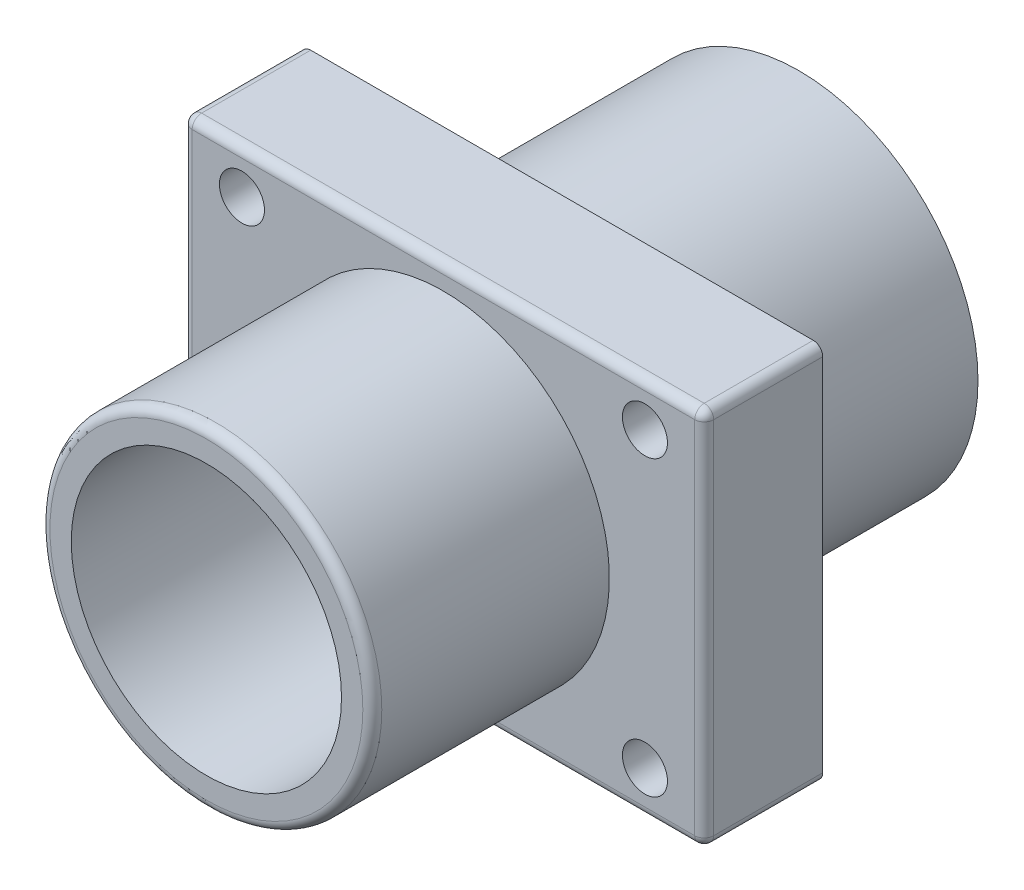
ISO-10303-21;
HEADER;
FILE_DESCRIPTION(('STEP AP214'),'2;1');
FILE_NAME('part.step','',(''),(''),'','','');
FILE_SCHEMA(('AUTOMOTIVE_DESIGN { 1 0 10303 214 1 1 1 1 }'));
ENDSEC;
DATA;
#1=APPLICATION_CONTEXT('core data for automotive mechanical design processes');
#2=APPLICATION_PROTOCOL_DEFINITION('international standard','automotive_design',2000,#1);
#3=PRODUCT_CONTEXT('',#1,'mechanical');
#4=PRODUCT('Part','Part','',(#3));
#5=PRODUCT_RELATED_PRODUCT_CATEGORY('part','',(#4));
#6=PRODUCT_DEFINITION_FORMATION('','',#4);
#7=PRODUCT_DEFINITION_CONTEXT('part definition',#1,'design');
#8=PRODUCT_DEFINITION('design','',#6,#7);
#9=PRODUCT_DEFINITION_SHAPE('','',#8);
#10=(LENGTH_UNIT() NAMED_UNIT(*) SI_UNIT(.MILLI.,.METRE.));
#11=(NAMED_UNIT(*) PLANE_ANGLE_UNIT() SI_UNIT($,.RADIAN.));
#12=(NAMED_UNIT(*) SI_UNIT($,.STERADIAN.) SOLID_ANGLE_UNIT());
#13=UNCERTAINTY_MEASURE_WITH_UNIT(LENGTH_MEASURE(1.E-05),#10,'distance_accuracy_value','');
#14=(GEOMETRIC_REPRESENTATION_CONTEXT(3) GLOBAL_UNCERTAINTY_ASSIGNED_CONTEXT((#13)) GLOBAL_UNIT_ASSIGNED_CONTEXT((#10,
#11,#12)) REPRESENTATION_CONTEXT('',''));
#15=CARTESIAN_POINT('',(0.,0.,0.));
#16=DIRECTION('',(0.,0.,1.));
#17=DIRECTION('',(1.,0.,0.));
#18=AXIS2_PLACEMENT_3D('',#15,#16,#17);
#19=CARTESIAN_POINT('',(42.5,30.9,0.));
#20=DIRECTION('',(0.,0.,1.));
#21=DIRECTION('',(1.,0.,0.));
#22=AXIS2_PLACEMENT_3D('',#19,#20,#21);
#23=CYLINDRICAL_SURFACE('',#22,4.75);
#24=CARTESIAN_POINT('',(42.5,30.9,0.));
#25=DIRECTION('',(0.,0.,1.));
#26=DIRECTION('',(1.,0.,0.));
#27=AXIS2_PLACEMENT_3D('',#24,#25,#26);
#28=CIRCLE('',#27,4.75);
#29=CARTESIAN_POINT('',(47.25,30.9,0.));
#30=VERTEX_POINT('',#29);
#31=EDGE_CURVE('E154',#30,#30,#28,.T.);
#32=ORIENTED_EDGE('',*,*,#31,.F.);
#33=EDGE_LOOP('',(#32));
#34=FACE_BOUND('',#33,.T.);
#35=CARTESIAN_POINT('',(42.5,30.9,25.));
#36=DIRECTION('',(0.,0.,1.));
#37=DIRECTION('',(1.,0.,0.));
#38=AXIS2_PLACEMENT_3D('',#35,#36,#37);
#39=CIRCLE('',#38,4.75);
#40=CARTESIAN_POINT('',(47.25,30.9,25.));
#41=VERTEX_POINT('',#40);
#42=EDGE_CURVE('E157',#41,#41,#39,.T.);
#43=ORIENTED_EDGE('',*,*,#42,.T.);
#44=EDGE_LOOP('',(#43));
#45=FACE_BOUND('',#44,.T.);
#46=ADVANCED_FACE('F35',(#34,#45),#23,.F.);
#47=CARTESIAN_POINT('',(-42.5,30.9,0.));
#48=DIRECTION('',(0.,0.,1.));
#49=DIRECTION('',(1.,0.,0.));
#50=AXIS2_PLACEMENT_3D('',#47,#48,#49);
#51=CYLINDRICAL_SURFACE('',#50,4.75);
#52=CARTESIAN_POINT('',(-42.5,30.9,0.));
#53=DIRECTION('',(0.,0.,1.));
#54=DIRECTION('',(1.,0.,0.));
#55=AXIS2_PLACEMENT_3D('',#52,#53,#54);
#56=CIRCLE('',#55,4.75);
#57=CARTESIAN_POINT('',(-37.75,30.9,0.));
#58=VERTEX_POINT('',#57);
#59=EDGE_CURVE('E143',#58,#58,#56,.T.);
#60=ORIENTED_EDGE('',*,*,#59,.F.);
#61=EDGE_LOOP('',(#60));
#62=FACE_BOUND('',#61,.T.);
#63=CARTESIAN_POINT('',(-42.5,30.9,25.));
#64=DIRECTION('',(0.,0.,1.));
#65=DIRECTION('',(1.,0.,0.));
#66=AXIS2_PLACEMENT_3D('',#63,#64,#65);
#67=CIRCLE('',#66,4.75);
#68=CARTESIAN_POINT('',(-37.75,30.9,25.));
#69=VERTEX_POINT('',#68);
#70=EDGE_CURVE('E151',#69,#69,#67,.T.);
#71=ORIENTED_EDGE('',*,*,#70,.T.);
#72=EDGE_LOOP('',(#71));
#73=FACE_BOUND('',#72,.T.);
#74=ADVANCED_FACE('F314',(#62,#73),#51,.F.);
#75=CARTESIAN_POINT('',(55.,-40.,25.));
#76=DIRECTION('',(-1.,0.,0.));
#77=DIRECTION('',(0.,0.,1.));
#78=AXIS2_PLACEMENT_3D('',#75,#76,#77);
#79=PLANE('',#78);
#80=DIRECTION('',(0.,1.,0.));
#81=VECTOR('',#80,1.);
#82=CARTESIAN_POINT('',(55.,-40.,0.));
#83=LINE('',#82,#81);
#84=CARTESIAN_POINT('',(55.,-38.,0.));
#85=VERTEX_POINT('',#84);
#86=CARTESIAN_POINT('',(55.,38.,0.));
#87=VERTEX_POINT('',#86);
#88=EDGE_CURVE('E145',#85,#87,#83,.T.);
#89=ORIENTED_EDGE('',*,*,#88,.T.);
#90=DIRECTION('',(0.,0.,-1.));
#91=VECTOR('',#90,1.);
#92=CARTESIAN_POINT('',(55.,38.,25.));
#93=LINE('',#92,#91);
#94=CARTESIAN_POINT('',(55.,38.,23.));
#95=VERTEX_POINT('',#94);
#96=EDGE_CURVE('E189',#87,#95,#93,.F.);
#97=ORIENTED_EDGE('',*,*,#96,.T.);
#98=DIRECTION('',(0.,1.,0.));
#99=VECTOR('',#98,1.);
#100=CARTESIAN_POINT('',(55.,-40.,23.));
#101=LINE('',#100,#99);
#102=CARTESIAN_POINT('',(55.,-38.,23.));
#103=VERTEX_POINT('',#102);
#104=EDGE_CURVE('E185',#95,#103,#101,.F.);
#105=ORIENTED_EDGE('',*,*,#104,.T.);
#106=DIRECTION('',(0.,0.,-1.));
#107=VECTOR('',#106,1.);
#108=CARTESIAN_POINT('',(55.,-38.,25.));
#109=LINE('',#108,#107);
#110=EDGE_CURVE('E187',#103,#85,#109,.T.);
#111=ORIENTED_EDGE('',*,*,#110,.T.);
#112=EDGE_LOOP('',(#89,#97,#105,#111));
#113=FACE_BOUND('',#112,.T.);
#114=ADVANCED_FACE('F268',(#113),#79,.F.);
#115=CARTESIAN_POINT('',(-55.,40.,25.));
#116=DIRECTION('',(0.,-1.,0.));
#117=DIRECTION('',(0.,0.,-1.));
#118=AXIS2_PLACEMENT_3D('',#115,#116,#117);
#119=PLANE('',#118);
#120=DIRECTION('',(-1.,0.,0.));
#121=VECTOR('',#120,1.);
#122=CARTESIAN_POINT('',(-55.,40.,0.));
#123=LINE('',#122,#121);
#124=CARTESIAN_POINT('',(53.,40.,0.));
#125=VERTEX_POINT('',#124);
#126=CARTESIAN_POINT('',(-53.,40.,0.));
#127=VERTEX_POINT('',#126);
#128=EDGE_CURVE('E140',#125,#127,#123,.T.);
#129=ORIENTED_EDGE('',*,*,#128,.T.);
#130=DIRECTION('',(0.,0.,-1.));
#131=VECTOR('',#130,1.);
#132=CARTESIAN_POINT('',(-53.,40.,25.));
#133=LINE('',#132,#131);
#134=CARTESIAN_POINT('',(-53.,40.,23.));
#135=VERTEX_POINT('',#134);
#136=EDGE_CURVE('E116',#127,#135,#133,.F.);
#137=ORIENTED_EDGE('',*,*,#136,.T.);
#138=DIRECTION('',(-1.,0.,0.));
#139=VECTOR('',#138,1.);
#140=CARTESIAN_POINT('',(-55.,40.,23.));
#141=LINE('',#140,#139);
#142=CARTESIAN_POINT('',(53.,40.,23.));
#143=VERTEX_POINT('',#142);
#144=EDGE_CURVE('E121',#135,#143,#141,.F.);
#145=ORIENTED_EDGE('',*,*,#144,.T.);
#146=DIRECTION('',(0.,0.,-1.));
#147=VECTOR('',#146,1.);
#148=CARTESIAN_POINT('',(53.,40.,25.));
#149=LINE('',#148,#147);
#150=EDGE_CURVE('E176',#143,#125,#149,.T.);
#151=ORIENTED_EDGE('',*,*,#150,.T.);
#152=EDGE_LOOP('',(#129,#137,#145,#151));
#153=FACE_BOUND('',#152,.T.);
#154=ADVANCED_FACE('F306',(#153),#119,.F.);
#155=CARTESIAN_POINT('',(-55.,-40.,25.));
#156=DIRECTION('',(1.,0.,0.));
#157=DIRECTION('',(0.,0.,-1.));
#158=AXIS2_PLACEMENT_3D('',#155,#156,#157);
#159=PLANE('',#158);
#160=DIRECTION('',(0.,-1.,0.));
#161=VECTOR('',#160,1.);
#162=CARTESIAN_POINT('',(-55.,-40.,23.));
#163=LINE('',#162,#161);
#164=CARTESIAN_POINT('',(-55.,-38.,23.));
#165=VERTEX_POINT('',#164);
#166=CARTESIAN_POINT('',(-55.,38.,23.));
#167=VERTEX_POINT('',#166);
#168=EDGE_CURVE('E130',#165,#167,#163,.F.);
#169=ORIENTED_EDGE('',*,*,#168,.T.);
#170=DIRECTION('',(0.,0.,-1.));
#171=VECTOR('',#170,1.);
#172=CARTESIAN_POINT('',(-55.,38.,25.));
#173=LINE('',#172,#171);
#174=CARTESIAN_POINT('',(-55.,38.,0.));
#175=VERTEX_POINT('',#174);
#176=EDGE_CURVE('E115',#167,#175,#173,.T.);
#177=ORIENTED_EDGE('',*,*,#176,.T.);
#178=DIRECTION('',(0.,-1.,0.));
#179=VECTOR('',#178,1.);
#180=CARTESIAN_POINT('',(-55.,-40.,0.));
#181=LINE('',#180,#179);
#182=CARTESIAN_POINT('',(-55.,-38.,0.));
#183=VERTEX_POINT('',#182);
#184=EDGE_CURVE('E127',#175,#183,#181,.T.);
#185=ORIENTED_EDGE('',*,*,#184,.T.);
#186=DIRECTION('',(0.,0.,-1.));
#187=VECTOR('',#186,1.);
#188=CARTESIAN_POINT('',(-55.,-38.,25.));
#189=LINE('',#188,#187);
#190=EDGE_CURVE('E133',#183,#165,#189,.F.);
#191=ORIENTED_EDGE('',*,*,#190,.T.);
#192=EDGE_LOOP('',(#169,#177,#185,#191));
#193=FACE_BOUND('',#192,.T.);
#194=ADVANCED_FACE('F126',(#193),#159,.F.);
#195=CARTESIAN_POINT('',(-55.,-40.,25.));
#196=DIRECTION('',(0.,1.,0.));
#197=DIRECTION('',(0.,0.,1.));
#198=AXIS2_PLACEMENT_3D('',#195,#196,#197);
#199=PLANE('',#198);
#200=DIRECTION('',(1.,0.,0.));
#201=VECTOR('',#200,1.);
#202=CARTESIAN_POINT('',(-55.,-40.,23.));
#203=LINE('',#202,#201);
#204=CARTESIAN_POINT('',(53.,-40.,23.));
#205=VERTEX_POINT('',#204);
#206=CARTESIAN_POINT('',(-53.,-40.,23.));
#207=VERTEX_POINT('',#206);
#208=EDGE_CURVE('E179',#205,#207,#203,.F.);
#209=ORIENTED_EDGE('',*,*,#208,.T.);
#210=DIRECTION('',(0.,0.,-1.));
#211=VECTOR('',#210,1.);
#212=CARTESIAN_POINT('',(-53.,-40.,25.));
#213=LINE('',#212,#211);
#214=CARTESIAN_POINT('',(-53.,-40.,0.));
#215=VERTEX_POINT('',#214);
#216=EDGE_CURVE('E183',#207,#215,#213,.T.);
#217=ORIENTED_EDGE('',*,*,#216,.T.);
#218=DIRECTION('',(1.,0.,0.));
#219=VECTOR('',#218,1.);
#220=CARTESIAN_POINT('',(-55.,-40.,0.));
#221=LINE('',#220,#219);
#222=CARTESIAN_POINT('',(53.,-40.,0.));
#223=VERTEX_POINT('',#222);
#224=EDGE_CURVE('E139',#215,#223,#221,.T.);
#225=ORIENTED_EDGE('',*,*,#224,.T.);
#226=DIRECTION('',(0.,0.,-1.));
#227=VECTOR('',#226,1.);
#228=CARTESIAN_POINT('',(53.,-40.,25.));
#229=LINE('',#228,#227);
#230=EDGE_CURVE('E181',#223,#205,#229,.F.);
#231=ORIENTED_EDGE('',*,*,#230,.T.);
#232=EDGE_LOOP('',(#209,#217,#225,#231));
#233=FACE_BOUND('',#232,.T.);
#234=ADVANCED_FACE('F284',(#233),#199,.F.);
#235=CARTESIAN_POINT('',(0.,0.,25.));
#236=DIRECTION('',(0.,0.,-1.));
#237=DIRECTION('',(-1.,0.,0.));
#238=AXIS2_PLACEMENT_3D('',#235,#236,#237);
#239=PLANE('',#238);
#240=DIRECTION('',(0.,-1.,0.));
#241=VECTOR('',#240,1.);
#242=CARTESIAN_POINT('',(-53.,0.,25.));
#243=LINE('',#242,#241);
#244=CARTESIAN_POINT('',(-53.,38.,25.));
#245=VERTEX_POINT('',#244);
#246=CARTESIAN_POINT('',(-53.,-38.,25.));
#247=VERTEX_POINT('',#246);
#248=EDGE_CURVE('E44',#245,#247,#243,.T.);
#249=ORIENTED_EDGE('',*,*,#248,.T.);
#250=DIRECTION('',(1.,0.,0.));
#251=VECTOR('',#250,1.);
#252=CARTESIAN_POINT('',(0.,-38.,25.));
#253=LINE('',#252,#251);
#254=CARTESIAN_POINT('',(53.,-38.,25.));
#255=VERTEX_POINT('',#254);
#256=EDGE_CURVE('E11',#247,#255,#253,.T.);
#257=ORIENTED_EDGE('',*,*,#256,.T.);
#258=DIRECTION('',(0.,1.,0.));
#259=VECTOR('',#258,1.);
#260=CARTESIAN_POINT('',(53.,0.,25.));
#261=LINE('',#260,#259);
#262=CARTESIAN_POINT('',(53.,38.,25.));
#263=VERTEX_POINT('',#262);
#264=EDGE_CURVE('E191',#255,#263,#261,.T.);
#265=ORIENTED_EDGE('',*,*,#264,.T.);
#266=DIRECTION('',(-1.,0.,0.));
#267=VECTOR('',#266,1.);
#268=CARTESIAN_POINT('',(0.,38.,25.));
#269=LINE('',#268,#267);
#270=EDGE_CURVE('E55',#263,#245,#269,.T.);
#271=ORIENTED_EDGE('',*,*,#270,.T.);
#272=EDGE_LOOP('',(#249,#257,#265,#271));
#273=FACE_BOUND('',#272,.T.);
#274=CARTESIAN_POINT('',(0.,0.,25.));
#275=DIRECTION('',(0.,0.,-1.));
#276=DIRECTION('',(-1.,0.,0.));
#277=AXIS2_PLACEMENT_3D('',#274,#275,#276);
#278=CIRCLE('',#277,35.);
#279=CARTESIAN_POINT('',(-35.,0.,25.));
#280=VERTEX_POINT('',#279);
#281=EDGE_CURVE('E160',#280,#280,#278,.F.);
#282=ORIENTED_EDGE('',*,*,#281,.F.);
#283=EDGE_LOOP('',(#282));
#284=FACE_BOUND('',#283,.T.);
#285=CARTESIAN_POINT('',(42.5,-30.9,25.));
#286=DIRECTION('',(0.,0.,1.));
#287=DIRECTION('',(1.,0.,0.));
#288=AXIS2_PLACEMENT_3D('',#285,#286,#287);
#289=CIRCLE('',#288,4.75);
#290=CARTESIAN_POINT('',(47.25,-30.9,25.));
#291=VERTEX_POINT('',#290);
#292=EDGE_CURVE('E256',#291,#291,#289,.T.);
#293=ORIENTED_EDGE('',*,*,#292,.F.);
#294=EDGE_LOOP('',(#293));
#295=FACE_BOUND('',#294,.T.);
#296=CARTESIAN_POINT('',(-42.5,-30.9,25.));
#297=DIRECTION('',(0.,0.,1.));
#298=DIRECTION('',(1.,0.,0.));
#299=AXIS2_PLACEMENT_3D('',#296,#297,#298);
#300=CIRCLE('',#299,4.75);
#301=CARTESIAN_POINT('',(-37.75,-30.9,25.));
#302=VERTEX_POINT('',#301);
#303=EDGE_CURVE('E259',#302,#302,#300,.T.);
#304=ORIENTED_EDGE('',*,*,#303,.F.);
#305=EDGE_LOOP('',(#304));
#306=FACE_BOUND('',#305,.T.);
#307=ORIENTED_EDGE('',*,*,#70,.F.);
#308=EDGE_LOOP('',(#307));
#309=FACE_BOUND('',#308,.T.);
#310=ORIENTED_EDGE('',*,*,#42,.F.);
#311=EDGE_LOOP('',(#310));
#312=FACE_BOUND('',#311,.T.);
#313=ADVANCED_FACE('F356',(#273,#284,#295,#306,#309,#312),#239,.F.);
#314=CARTESIAN_POINT('',(0.,0.,0.));
#315=DIRECTION('',(0.,0.,-1.));
#316=DIRECTION('',(-1.,0.,0.));
#317=AXIS2_PLACEMENT_3D('',#314,#315,#316);
#318=PLANE('',#317);
#319=CARTESIAN_POINT('',(0.,0.,0.));
#320=DIRECTION('',(0.,0.,-1.));
#321=DIRECTION('',(-1.,0.,0.));
#322=AXIS2_PLACEMENT_3D('',#319,#320,#321);
#323=CIRCLE('',#322,37.75);
#324=CARTESIAN_POINT('',(-37.75,0.,0.));
#325=VERTEX_POINT('',#324);
#326=EDGE_CURVE('E245',#325,#325,#323,.T.);
#327=ORIENTED_EDGE('',*,*,#326,.F.);
#328=EDGE_LOOP('',(#327));
#329=FACE_BOUND('',#328,.T.);
#330=CARTESIAN_POINT('',(42.5,-30.9,0.));
#331=DIRECTION('',(0.,0.,1.));
#332=DIRECTION('',(1.,0.,0.));
#333=AXIS2_PLACEMENT_3D('',#330,#331,#332);
#334=CIRCLE('',#333,4.75);
#335=CARTESIAN_POINT('',(47.25,-30.9,0.));
#336=VERTEX_POINT('',#335);
#337=EDGE_CURVE('E251',#336,#336,#334,.T.);
#338=ORIENTED_EDGE('',*,*,#337,.T.);
#339=EDGE_LOOP('',(#338));
#340=FACE_BOUND('',#339,.T.);
#341=CARTESIAN_POINT('',(-42.5,-30.9,0.));
#342=DIRECTION('',(0.,0.,1.));
#343=DIRECTION('',(1.,0.,0.));
#344=AXIS2_PLACEMENT_3D('',#341,#342,#343);
#345=CIRCLE('',#344,4.75);
#346=CARTESIAN_POINT('',(-37.75,-30.9,0.));
#347=VERTEX_POINT('',#346);
#348=EDGE_CURVE('E260',#347,#347,#345,.T.);
#349=ORIENTED_EDGE('',*,*,#348,.T.);
#350=EDGE_LOOP('',(#349));
#351=FACE_BOUND('',#350,.T.);
#352=ORIENTED_EDGE('',*,*,#184,.F.);
#353=CARTESIAN_POINT('',(-53.,38.,0.));
#354=DIRECTION('',(0.,0.,-1.));
#355=DIRECTION('',(-1.,0.,0.));
#356=AXIS2_PLACEMENT_3D('',#353,#354,#355);
#357=CIRCLE('',#356,2.);
#358=EDGE_CURVE('E111',#175,#127,#357,.T.);
#359=ORIENTED_EDGE('',*,*,#358,.T.);
#360=ORIENTED_EDGE('',*,*,#128,.F.);
#361=CARTESIAN_POINT('',(53.,38.,0.));
#362=DIRECTION('',(0.,0.,-1.));
#363=DIRECTION('',(-1.,0.,0.));
#364=AXIS2_PLACEMENT_3D('',#361,#362,#363);
#365=CIRCLE('',#364,2.);
#366=EDGE_CURVE('E172',#125,#87,#365,.T.);
#367=ORIENTED_EDGE('',*,*,#366,.T.);
#368=ORIENTED_EDGE('',*,*,#88,.F.);
#369=CARTESIAN_POINT('',(53.,-38.,0.));
#370=DIRECTION('',(0.,0.,-1.));
#371=DIRECTION('',(-1.,0.,0.));
#372=AXIS2_PLACEMENT_3D('',#369,#370,#371);
#373=CIRCLE('',#372,2.);
#374=EDGE_CURVE('E132',#85,#223,#373,.T.);
#375=ORIENTED_EDGE('',*,*,#374,.T.);
#376=ORIENTED_EDGE('',*,*,#224,.F.);
#377=CARTESIAN_POINT('',(-53.,-38.,0.));
#378=DIRECTION('',(0.,0.,-1.));
#379=DIRECTION('',(-1.,0.,0.));
#380=AXIS2_PLACEMENT_3D('',#377,#378,#379);
#381=CIRCLE('',#380,2.);
#382=EDGE_CURVE('E122',#215,#183,#381,.T.);
#383=ORIENTED_EDGE('',*,*,#382,.T.);
#384=EDGE_LOOP('',(#352,#359,#360,#367,#368,#375,#376,#383));
#385=FACE_BOUND('',#384,.T.);
#386=ORIENTED_EDGE('',*,*,#59,.T.);
#387=EDGE_LOOP('',(#386));
#388=FACE_BOUND('',#387,.T.);
#389=ORIENTED_EDGE('',*,*,#31,.T.);
#390=EDGE_LOOP('',(#389));
#391=FACE_BOUND('',#390,.T.);
#392=ADVANCED_FACE('F135',(#329,#340,#351,#385,#388,#391),#318,.T.);
#393=CARTESIAN_POINT('',(-42.5,-30.9,0.));
#394=DIRECTION('',(0.,0.,1.));
#395=DIRECTION('',(1.,0.,0.));
#396=AXIS2_PLACEMENT_3D('',#393,#394,#395);
#397=CYLINDRICAL_SURFACE('',#396,4.75);
#398=ORIENTED_EDGE('',*,*,#348,.F.);
#399=EDGE_LOOP('',(#398));
#400=FACE_BOUND('',#399,.T.);
#401=ORIENTED_EDGE('',*,*,#303,.T.);
#402=EDGE_LOOP('',(#401));
#403=FACE_BOUND('',#402,.T.);
#404=ADVANCED_FACE('F371',(#400,#403),#397,.F.);
#405=CARTESIAN_POINT('',(42.5,-30.9,0.));
#406=DIRECTION('',(0.,0.,1.));
#407=DIRECTION('',(1.,0.,0.));
#408=AXIS2_PLACEMENT_3D('',#405,#406,#407);
#409=CYLINDRICAL_SURFACE('',#408,4.75);
#410=ORIENTED_EDGE('',*,*,#337,.F.);
#411=EDGE_LOOP('',(#410));
#412=FACE_BOUND('',#411,.T.);
#413=ORIENTED_EDGE('',*,*,#292,.T.);
#414=EDGE_LOOP('',(#413));
#415=FACE_BOUND('',#414,.T.);
#416=ADVANCED_FACE('F373',(#412,#415),#409,.F.);
#417=CARTESIAN_POINT('',(0.,0.,75.));
#418=DIRECTION('',(0.,0.,-1.));
#419=DIRECTION('',(-1.,0.,0.));
#420=AXIS2_PLACEMENT_3D('',#417,#418,#419);
#421=CYLINDRICAL_SURFACE('',#420,35.);
#422=CARTESIAN_POINT('',(0.,0.,73.));
#423=DIRECTION('',(0.,0.,1.));
#424=DIRECTION('',(1.,0.,0.));
#425=AXIS2_PLACEMENT_3D('',#422,#423,#424);
#426=CIRCLE('',#425,35.);
#427=CARTESIAN_POINT('',(35.,0.,73.));
#428=VERTEX_POINT('',#427);
#429=EDGE_CURVE('E166',#428,#428,#426,.F.);
#430=ORIENTED_EDGE('',*,*,#429,.T.);
#431=EDGE_LOOP('',(#430));
#432=FACE_BOUND('',#431,.T.);
#433=ORIENTED_EDGE('',*,*,#281,.T.);
#434=EDGE_LOOP('',(#433));
#435=FACE_BOUND('',#434,.T.);
#436=ADVANCED_FACE('F380',(#432,#435),#421,.T.);
#437=CARTESIAN_POINT('',(0.,0.,75.));
#438=DIRECTION('',(0.,0.,1.));
#439=DIRECTION('',(1.,0.,0.));
#440=AXIS2_PLACEMENT_3D('',#437,#438,#439);
#441=PLANE('',#440);
#442=CARTESIAN_POINT('',(0.,0.,75.));
#443=DIRECTION('',(0.,0.,1.));
#444=DIRECTION('',(1.,0.,0.));
#445=AXIS2_PLACEMENT_3D('',#442,#443,#444);
#446=CIRCLE('',#445,33.);
#447=CARTESIAN_POINT('',(33.,0.,75.));
#448=VERTEX_POINT('',#447);
#449=EDGE_CURVE('E163',#448,#448,#446,.T.);
#450=ORIENTED_EDGE('',*,*,#449,.T.);
#451=EDGE_LOOP('',(#450));
#452=FACE_BOUND('',#451,.T.);
#453=CARTESIAN_POINT('',(0.,0.,75.));
#454=DIRECTION('',(0.,0.,1.));
#455=DIRECTION('',(1.,0.,0.));
#456=AXIS2_PLACEMENT_3D('',#453,#454,#455);
#457=CIRCLE('',#456,28.5);
#458=CARTESIAN_POINT('',(28.5,0.,75.));
#459=VERTEX_POINT('',#458);
#460=EDGE_CURVE('E239',#459,#459,#457,.T.);
#461=ORIENTED_EDGE('',*,*,#460,.F.);
#462=EDGE_LOOP('',(#461));
#463=FACE_BOUND('',#462,.T.);
#464=ADVANCED_FACE('F411',(#452,#463),#441,.T.);
#465=CARTESIAN_POINT('',(0.,0.,-50.));
#466=DIRECTION('',(0.,0.,1.));
#467=DIRECTION('',(1.,0.,0.));
#468=AXIS2_PLACEMENT_3D('',#465,#466,#467);
#469=CYLINDRICAL_SURFACE('',#468,37.75);
#470=CARTESIAN_POINT('',(0.,0.,-50.));
#471=DIRECTION('',(0.,0.,-1.));
#472=DIRECTION('',(-1.,0.,0.));
#473=AXIS2_PLACEMENT_3D('',#470,#471,#472);
#474=CIRCLE('',#473,37.75);
#475=CARTESIAN_POINT('',(-37.75,0.,-50.));
#476=VERTEX_POINT('',#475);
#477=EDGE_CURVE('E248',#476,#476,#474,.T.);
#478=ORIENTED_EDGE('',*,*,#477,.F.);
#479=EDGE_LOOP('',(#478));
#480=FACE_BOUND('',#479,.T.);
#481=ORIENTED_EDGE('',*,*,#326,.T.);
#482=EDGE_LOOP('',(#481));
#483=FACE_BOUND('',#482,.T.);
#484=ADVANCED_FACE('F421',(#480,#483),#469,.T.);
#485=CARTESIAN_POINT('',(0.,0.,-50.));
#486=DIRECTION('',(0.,0.,-1.));
#487=DIRECTION('',(-1.,0.,0.));
#488=AXIS2_PLACEMENT_3D('',#485,#486,#487);
#489=PLANE('',#488);
#490=CARTESIAN_POINT('',(0.,0.,-50.));
#491=DIRECTION('',(0.,0.,1.));
#492=DIRECTION('',(1.,0.,0.));
#493=AXIS2_PLACEMENT_3D('',#490,#491,#492);
#494=CIRCLE('',#493,23.);
#495=CARTESIAN_POINT('',(23.,0.,-50.));
#496=VERTEX_POINT('',#495);
#497=EDGE_CURVE('E234',#496,#496,#494,.T.);
#498=ORIENTED_EDGE('',*,*,#497,.T.);
#499=EDGE_LOOP('',(#498));
#500=FACE_BOUND('',#499,.T.);
#501=ORIENTED_EDGE('',*,*,#477,.T.);
#502=EDGE_LOOP('',(#501));
#503=FACE_BOUND('',#502,.T.);
#504=ADVANCED_FACE('F526',(#500,#503),#489,.T.);
#505=CARTESIAN_POINT('',(0.,0.,0.));
#506=DIRECTION('',(0.,0.,1.));
#507=DIRECTION('',(1.,0.,0.));
#508=AXIS2_PLACEMENT_3D('',#505,#506,#507);
#509=CYLINDRICAL_SURFACE('',#508,28.5);
#510=CARTESIAN_POINT('',(0.,0.,0.));
#511=DIRECTION('',(0.,0.,1.));
#512=DIRECTION('',(1.,0.,0.));
#513=AXIS2_PLACEMENT_3D('',#510,#511,#512);
#514=CIRCLE('',#513,28.5);
#515=CARTESIAN_POINT('',(28.5,0.,0.));
#516=VERTEX_POINT('',#515);
#517=EDGE_CURVE('E242',#516,#516,#514,.T.);
#518=ORIENTED_EDGE('',*,*,#517,.F.);
#519=EDGE_LOOP('',(#518));
#520=FACE_BOUND('',#519,.T.);
#521=ORIENTED_EDGE('',*,*,#460,.T.);
#522=EDGE_LOOP('',(#521));
#523=FACE_BOUND('',#522,.T.);
#524=ADVANCED_FACE('F517',(#520,#523),#509,.F.);
#525=CARTESIAN_POINT('',(0.,0.,0.));
#526=DIRECTION('',(0.,0.,1.));
#527=DIRECTION('',(1.,0.,0.));
#528=AXIS2_PLACEMENT_3D('',#525,#526,#527);
#529=PLANE('',#528);
#530=CARTESIAN_POINT('',(0.,0.,0.));
#531=DIRECTION('',(0.,0.,1.));
#532=DIRECTION('',(1.,0.,0.));
#533=AXIS2_PLACEMENT_3D('',#530,#531,#532);
#534=CIRCLE('',#533,23.);
#535=CARTESIAN_POINT('',(23.,0.,0.));
#536=VERTEX_POINT('',#535);
#537=EDGE_CURVE('E229',#536,#536,#534,.T.);
#538=ORIENTED_EDGE('',*,*,#537,.F.);
#539=EDGE_LOOP('',(#538));
#540=FACE_BOUND('',#539,.T.);
#541=ORIENTED_EDGE('',*,*,#517,.T.);
#542=EDGE_LOOP('',(#541));
#543=FACE_BOUND('',#542,.T.);
#544=ADVANCED_FACE('F509',(#540,#543),#529,.T.);
#545=CARTESIAN_POINT('',(0.,0.,-50.));
#546=DIRECTION('',(0.,0.,1.));
#547=DIRECTION('',(1.,0.,0.));
#548=AXIS2_PLACEMENT_3D('',#545,#546,#547);
#549=CYLINDRICAL_SURFACE('',#548,23.);
#550=ORIENTED_EDGE('',*,*,#497,.F.);
#551=EDGE_LOOP('',(#550));
#552=FACE_BOUND('',#551,.T.);
#553=ORIENTED_EDGE('',*,*,#537,.T.);
#554=EDGE_LOOP('',(#553));
#555=FACE_BOUND('',#554,.T.);
#556=ADVANCED_FACE('F330',(#552,#555),#549,.F.);
#557=CARTESIAN_POINT('',(0.,0.,73.));
#558=DIRECTION('',(0.,0.,1.));
#559=DIRECTION('',(1.,0.,0.));
#560=AXIS2_PLACEMENT_3D('',#557,#558,#559);
#561=TOROIDAL_SURFACE('',#560,33.,2.);
#562=ORIENTED_EDGE('',*,*,#429,.F.);
#563=EDGE_LOOP('',(#562));
#564=FACE_BOUND('',#563,.T.);
#565=ORIENTED_EDGE('',*,*,#449,.F.);
#566=EDGE_LOOP('',(#565));
#567=FACE_BOUND('',#566,.T.);
#568=ADVANCED_FACE('F327',(#564,#567),#561,.T.);
#569=CARTESIAN_POINT('',(53.,-38.,25.));
#570=DIRECTION('',(0.,0.,-1.));
#571=DIRECTION('',(-1.,0.,0.));
#572=AXIS2_PLACEMENT_3D('',#569,#570,#571);
#573=CYLINDRICAL_SURFACE('',#572,2.);
#574=CARTESIAN_POINT('',(53.,-38.,23.));
#575=DIRECTION('',(0.,0.,1.));
#576=DIRECTION('',(1.,0.,0.));
#577=AXIS2_PLACEMENT_3D('',#574,#575,#576);
#578=CIRCLE('',#577,2.);
#579=EDGE_CURVE('E39',#205,#103,#578,.T.);
#580=ORIENTED_EDGE('',*,*,#579,.F.);
#581=ORIENTED_EDGE('',*,*,#230,.F.);
#582=ORIENTED_EDGE('',*,*,#374,.F.);
#583=ORIENTED_EDGE('',*,*,#110,.F.);
#584=EDGE_LOOP('',(#580,#581,#582,#583));
#585=FACE_BOUND('',#584,.T.);
#586=ADVANCED_FACE('F37',(#585),#573,.T.);
#587=CARTESIAN_POINT('',(53.,-38.,23.));
#588=DIRECTION('',(0.,0.,1.));
#589=DIRECTION('',(1.,0.,0.));
#590=AXIS2_PLACEMENT_3D('',#587,#588,#589);
#591=SPHERICAL_SURFACE('',#590,2.);
#592=CARTESIAN_POINT('',(53.,-38.,23.));
#593=DIRECTION('',(1.,0.,0.));
#594=DIRECTION('',(0.,0.,-1.));
#595=AXIS2_PLACEMENT_3D('',#592,#593,#594);
#596=CIRCLE('',#595,2.);
#597=EDGE_CURVE('E221',#205,#255,#596,.F.);
#598=ORIENTED_EDGE('',*,*,#597,.F.);
#599=ORIENTED_EDGE('',*,*,#579,.T.);
#600=CARTESIAN_POINT('',(53.,-38.,23.));
#601=DIRECTION('',(0.,-1.,0.));
#602=DIRECTION('',(0.,0.,-1.));
#603=AXIS2_PLACEMENT_3D('',#600,#601,#602);
#604=CIRCLE('',#603,2.);
#605=EDGE_CURVE('E223',#255,#103,#604,.F.);
#606=ORIENTED_EDGE('',*,*,#605,.F.);
#607=EDGE_LOOP('',(#598,#599,#606));
#608=FACE_BOUND('',#607,.T.);
#609=ADVANCED_FACE('F351',(#608),#591,.T.);
#610=CARTESIAN_POINT('',(53.,38.,25.));
#611=DIRECTION('',(0.,0.,-1.));
#612=DIRECTION('',(-1.,0.,0.));
#613=AXIS2_PLACEMENT_3D('',#610,#611,#612);
#614=CYLINDRICAL_SURFACE('',#613,2.);
#615=ORIENTED_EDGE('',*,*,#366,.F.);
#616=ORIENTED_EDGE('',*,*,#150,.F.);
#617=CARTESIAN_POINT('',(53.,38.,23.));
#618=DIRECTION('',(0.,0.,1.));
#619=DIRECTION('',(1.,0.,0.));
#620=AXIS2_PLACEMENT_3D('',#617,#618,#619);
#621=CIRCLE('',#620,2.);
#622=EDGE_CURVE('E218',#95,#143,#621,.T.);
#623=ORIENTED_EDGE('',*,*,#622,.F.);
#624=ORIENTED_EDGE('',*,*,#96,.F.);
#625=EDGE_LOOP('',(#615,#616,#623,#624));
#626=FACE_BOUND('',#625,.T.);
#627=ADVANCED_FACE('F274',(#626),#614,.T.);
#628=CARTESIAN_POINT('',(53.,0.,23.));
#629=DIRECTION('',(0.,1.,0.));
#630=DIRECTION('',(0.,0.,1.));
#631=AXIS2_PLACEMENT_3D('',#628,#629,#630);
#632=CYLINDRICAL_SURFACE('',#631,2.);
#633=ORIENTED_EDGE('',*,*,#605,.T.);
#634=ORIENTED_EDGE('',*,*,#104,.F.);
#635=CARTESIAN_POINT('',(53.,38.,23.));
#636=DIRECTION('',(0.,1.,0.));
#637=DIRECTION('',(0.,0.,1.));
#638=AXIS2_PLACEMENT_3D('',#635,#636,#637);
#639=CIRCLE('',#638,2.);
#640=EDGE_CURVE('E215',#263,#95,#639,.T.);
#641=ORIENTED_EDGE('',*,*,#640,.F.);
#642=ORIENTED_EDGE('',*,*,#264,.F.);
#643=EDGE_LOOP('',(#633,#634,#641,#642));
#644=FACE_BOUND('',#643,.T.);
#645=ADVANCED_FACE('F280',(#644),#632,.T.);
#646=CARTESIAN_POINT('',(0.,-38.,23.));
#647=DIRECTION('',(1.,0.,0.));
#648=DIRECTION('',(0.,0.,-1.));
#649=AXIS2_PLACEMENT_3D('',#646,#647,#648);
#650=CYLINDRICAL_SURFACE('',#649,2.);
#651=ORIENTED_EDGE('',*,*,#597,.T.);
#652=ORIENTED_EDGE('',*,*,#256,.F.);
#653=CARTESIAN_POINT('',(-53.,-38.,23.));
#654=DIRECTION('',(-1.,0.,0.));
#655=DIRECTION('',(0.,0.,1.));
#656=AXIS2_PLACEMENT_3D('',#653,#654,#655);
#657=CIRCLE('',#656,2.);
#658=EDGE_CURVE('E212',#207,#247,#657,.T.);
#659=ORIENTED_EDGE('',*,*,#658,.F.);
#660=ORIENTED_EDGE('',*,*,#208,.F.);
#661=EDGE_LOOP('',(#651,#652,#659,#660));
#662=FACE_BOUND('',#661,.T.);
#663=ADVANCED_FACE('F293',(#662),#650,.T.);
#664=CARTESIAN_POINT('',(-53.,-38.,25.));
#665=DIRECTION('',(0.,0.,-1.));
#666=DIRECTION('',(-1.,0.,0.));
#667=AXIS2_PLACEMENT_3D('',#664,#665,#666);
#668=CYLINDRICAL_SURFACE('',#667,2.);
#669=ORIENTED_EDGE('',*,*,#382,.F.);
#670=ORIENTED_EDGE('',*,*,#216,.F.);
#671=CARTESIAN_POINT('',(-53.,-38.,23.));
#672=DIRECTION('',(0.,0.,1.));
#673=DIRECTION('',(1.,0.,0.));
#674=AXIS2_PLACEMENT_3D('',#671,#672,#673);
#675=CIRCLE('',#674,2.);
#676=EDGE_CURVE('E209',#165,#207,#675,.T.);
#677=ORIENTED_EDGE('',*,*,#676,.F.);
#678=ORIENTED_EDGE('',*,*,#190,.F.);
#679=EDGE_LOOP('',(#669,#670,#677,#678));
#680=FACE_BOUND('',#679,.T.);
#681=ADVANCED_FACE('F290',(#680),#668,.T.);
#682=CARTESIAN_POINT('',(53.,38.,23.));
#683=DIRECTION('',(0.,0.,1.));
#684=DIRECTION('',(1.,0.,0.));
#685=AXIS2_PLACEMENT_3D('',#682,#683,#684);
#686=SPHERICAL_SURFACE('',#685,2.);
#687=ORIENTED_EDGE('',*,*,#640,.T.);
#688=ORIENTED_EDGE('',*,*,#622,.T.);
#689=CARTESIAN_POINT('',(53.,38.,23.));
#690=DIRECTION('',(1.,0.,0.));
#691=DIRECTION('',(0.,0.,-1.));
#692=AXIS2_PLACEMENT_3D('',#689,#690,#691);
#693=CIRCLE('',#692,2.);
#694=EDGE_CURVE('E206',#263,#143,#693,.F.);
#695=ORIENTED_EDGE('',*,*,#694,.F.);
#696=EDGE_LOOP('',(#687,#688,#695));
#697=FACE_BOUND('',#696,.T.);
#698=ADVANCED_FACE('F279',(#697),#686,.T.);
#699=CARTESIAN_POINT('',(-53.,-38.,23.));
#700=DIRECTION('',(0.,0.,1.));
#701=DIRECTION('',(1.,0.,0.));
#702=AXIS2_PLACEMENT_3D('',#699,#700,#701);
#703=SPHERICAL_SURFACE('',#702,2.);
#704=ORIENTED_EDGE('',*,*,#676,.T.);
#705=ORIENTED_EDGE('',*,*,#658,.T.);
#706=CARTESIAN_POINT('',(-53.,-38.,23.));
#707=DIRECTION('',(0.,-1.,0.));
#708=DIRECTION('',(0.,0.,-1.));
#709=AXIS2_PLACEMENT_3D('',#706,#707,#708);
#710=CIRCLE('',#709,2.);
#711=EDGE_CURVE('E203',#165,#247,#710,.F.);
#712=ORIENTED_EDGE('',*,*,#711,.F.);
#713=EDGE_LOOP('',(#704,#705,#712));
#714=FACE_BOUND('',#713,.T.);
#715=ADVANCED_FACE('F295',(#714),#703,.T.);
#716=CARTESIAN_POINT('',(0.,38.,23.));
#717=DIRECTION('',(-1.,0.,0.));
#718=DIRECTION('',(0.,0.,1.));
#719=AXIS2_PLACEMENT_3D('',#716,#717,#718);
#720=CYLINDRICAL_SURFACE('',#719,2.);
#721=ORIENTED_EDGE('',*,*,#694,.T.);
#722=ORIENTED_EDGE('',*,*,#144,.F.);
#723=CARTESIAN_POINT('',(-53.,38.,23.));
#724=DIRECTION('',(-1.,0.,0.));
#725=DIRECTION('',(0.,0.,1.));
#726=AXIS2_PLACEMENT_3D('',#723,#724,#725);
#727=CIRCLE('',#726,2.);
#728=EDGE_CURVE('E200',#245,#135,#727,.T.);
#729=ORIENTED_EDGE('',*,*,#728,.F.);
#730=ORIENTED_EDGE('',*,*,#270,.F.);
#731=EDGE_LOOP('',(#721,#722,#729,#730));
#732=FACE_BOUND('',#731,.T.);
#733=ADVANCED_FACE('F304',(#732),#720,.T.);
#734=CARTESIAN_POINT('',(-53.,0.,23.));
#735=DIRECTION('',(0.,-1.,0.));
#736=DIRECTION('',(0.,0.,-1.));
#737=AXIS2_PLACEMENT_3D('',#734,#735,#736);
#738=CYLINDRICAL_SURFACE('',#737,2.);
#739=ORIENTED_EDGE('',*,*,#711,.T.);
#740=ORIENTED_EDGE('',*,*,#248,.F.);
#741=CARTESIAN_POINT('',(-53.,38.,23.));
#742=DIRECTION('',(0.,1.,0.));
#743=DIRECTION('',(0.,0.,1.));
#744=AXIS2_PLACEMENT_3D('',#741,#742,#743);
#745=CIRCLE('',#744,2.);
#746=EDGE_CURVE('E197',#167,#245,#745,.T.);
#747=ORIENTED_EDGE('',*,*,#746,.F.);
#748=ORIENTED_EDGE('',*,*,#168,.F.);
#749=EDGE_LOOP('',(#739,#740,#747,#748));
#750=FACE_BOUND('',#749,.T.);
#751=ADVANCED_FACE('F297',(#750),#738,.T.);
#752=CARTESIAN_POINT('',(-53.,38.,23.));
#753=DIRECTION('',(0.,0.,1.));
#754=DIRECTION('',(1.,0.,0.));
#755=AXIS2_PLACEMENT_3D('',#752,#753,#754);
#756=SPHERICAL_SURFACE('',#755,2.);
#757=ORIENTED_EDGE('',*,*,#746,.T.);
#758=ORIENTED_EDGE('',*,*,#728,.T.);
#759=CARTESIAN_POINT('',(-53.,38.,23.));
#760=DIRECTION('',(0.,0.,1.));
#761=DIRECTION('',(1.,0.,0.));
#762=AXIS2_PLACEMENT_3D('',#759,#760,#761);
#763=CIRCLE('',#762,2.);
#764=EDGE_CURVE('E195',#167,#135,#763,.F.);
#765=ORIENTED_EDGE('',*,*,#764,.F.);
#766=EDGE_LOOP('',(#757,#758,#765));
#767=FACE_BOUND('',#766,.T.);
#768=ADVANCED_FACE('F301',(#767),#756,.T.);
#769=CARTESIAN_POINT('',(-53.,38.,25.));
#770=DIRECTION('',(0.,0.,-1.));
#771=DIRECTION('',(-1.,0.,0.));
#772=AXIS2_PLACEMENT_3D('',#769,#770,#771);
#773=CYLINDRICAL_SURFACE('',#772,2.);
#774=ORIENTED_EDGE('',*,*,#764,.T.);
#775=ORIENTED_EDGE('',*,*,#136,.F.);
#776=ORIENTED_EDGE('',*,*,#358,.F.);
#777=ORIENTED_EDGE('',*,*,#176,.F.);
#778=EDGE_LOOP('',(#774,#775,#776,#777));
#779=FACE_BOUND('',#778,.T.);
#780=ADVANCED_FACE('F114',(#779),#773,.T.);
#781=CLOSED_SHELL('',(#46,#74,#114,#154,#194,#234,#313,#392,#404,#416,#436,#464,#484,#504,#524,
#544,#556,#568,#586,#609,#627,#645,#663,#681,#698,#715,#733,#751,#768,#780));
#782=MANIFOLD_SOLID_BREP('B2',#781);
#783=ADVANCED_BREP_SHAPE_REPRESENTATION('',(#18,#782),#14);
#784=SHAPE_DEFINITION_REPRESENTATION(#9,#783);
ENDSEC;
END-ISO-10303-21;
